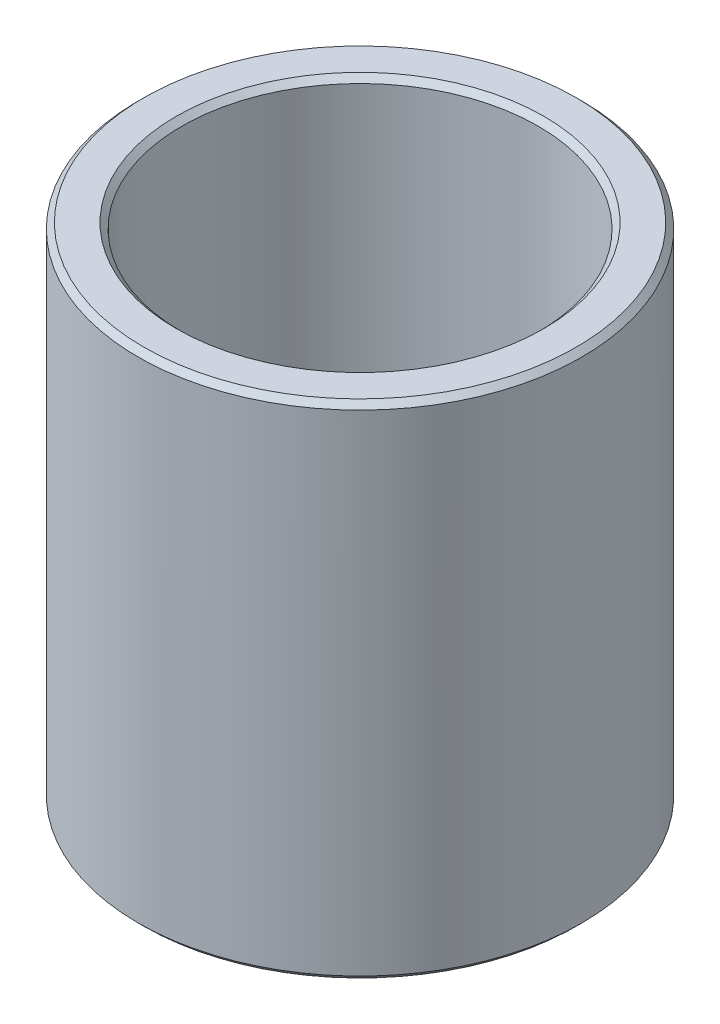
ISO-10303-21;
HEADER;
FILE_DESCRIPTION(('STEP AP214'),'2;1');
FILE_NAME('part.step','',(''),(''),'','','');
FILE_SCHEMA(('AUTOMOTIVE_DESIGN { 1 0 10303 214 1 1 1 1 }'));
ENDSEC;
DATA;
#1=APPLICATION_CONTEXT('core data for automotive mechanical design processes');
#2=APPLICATION_PROTOCOL_DEFINITION('international standard','automotive_design',2000,#1);
#3=PRODUCT_CONTEXT('',#1,'mechanical');
#4=PRODUCT('Part','Part','',(#3));
#5=PRODUCT_RELATED_PRODUCT_CATEGORY('part','',(#4));
#6=PRODUCT_DEFINITION_FORMATION('','',#4);
#7=PRODUCT_DEFINITION_CONTEXT('part definition',#1,'design');
#8=PRODUCT_DEFINITION('design','',#6,#7);
#9=PRODUCT_DEFINITION_SHAPE('','',#8);
#10=(LENGTH_UNIT() NAMED_UNIT(*) SI_UNIT(.MILLI.,.METRE.));
#11=(NAMED_UNIT(*) PLANE_ANGLE_UNIT() SI_UNIT($,.RADIAN.));
#12=(NAMED_UNIT(*) SI_UNIT($,.STERADIAN.) SOLID_ANGLE_UNIT());
#13=UNCERTAINTY_MEASURE_WITH_UNIT(LENGTH_MEASURE(1.E-05),#10,'distance_accuracy_value','');
#14=(GEOMETRIC_REPRESENTATION_CONTEXT(3) GLOBAL_UNCERTAINTY_ASSIGNED_CONTEXT((#13)) GLOBAL_UNIT_ASSIGNED_CONTEXT((#10,
#11,#12)) REPRESENTATION_CONTEXT('',''));
#15=CARTESIAN_POINT('',(0.,0.,0.));
#16=DIRECTION('',(0.,0.,1.));
#17=DIRECTION('',(1.,0.,0.));
#18=AXIS2_PLACEMENT_3D('',#15,#16,#17);
#19=CARTESIAN_POINT('',(0.,33.9125093154234,0.));
#20=DIRECTION('',(0.,-1.,0.));
#21=DIRECTION('',(0.,0.,-1.));
#22=AXIS2_PLACEMENT_3D('',#19,#20,#21);
#23=CYLINDRICAL_SURFACE('',#22,15.);
#24=CARTESIAN_POINT('',(0.,0.384864635886488,0.));
#25=DIRECTION('',(0.,1.,0.));
#26=DIRECTION('',(0.,0.,1.));
#27=AXIS2_PLACEMENT_3D('',#24,#25,#26);
#28=CIRCLE('',#27,15.);
#29=CARTESIAN_POINT('',(0.,0.384864635886481,-15.));
#30=VERTEX_POINT('',#29);
#31=EDGE_CURVE('E10',#30,#30,#28,.T.);
#32=CARTESIAN_POINT('',(0.,33.5276446795369,0.));
#33=DIRECTION('',(0.,1.,0.));
#34=DIRECTION('',(0.,0.,1.));
#35=AXIS2_PLACEMENT_3D('',#32,#33,#34);
#36=CIRCLE('',#35,15.);
#37=CARTESIAN_POINT('',(0.,33.5276446795369,-15.));
#38=VERTEX_POINT('',#37);
#39=EDGE_CURVE('E50',#38,#38,#36,.F.);
#40=CARTESIAN_POINT('',(0.,0.384864635886481,-15.));
#41=CARTESIAN_POINT('',(0.,0.730101928007839,-15.));
#42=CARTESIAN_POINT('',(0.,1.0753392201292,-15.));
#43=CARTESIAN_POINT('',(0.,1.76581380437191,-15.));
#44=CARTESIAN_POINT('',(0.,2.11105109649327,-15.));
#45=CARTESIAN_POINT('',(0.,2.80152568073599,-15.));
#46=CARTESIAN_POINT('',(0.,3.14676297285735,-15.));
#47=CARTESIAN_POINT('',(0.,3.83723755710006,-15.));
#48=CARTESIAN_POINT('',(0.,4.18247484922142,-15.));
#49=CARTESIAN_POINT('',(0.,4.87294943346414,-15.));
#50=CARTESIAN_POINT('',(0.,5.2181867255855,-15.));
#51=CARTESIAN_POINT('',(0.,5.90866130982821,-15.));
#52=CARTESIAN_POINT('',(0.,6.25389860194957,-15.));
#53=CARTESIAN_POINT('',(0.,6.94437318619229,-15.));
#54=CARTESIAN_POINT('',(0.,7.28961047831364,-15.));
#55=CARTESIAN_POINT('',(0.,7.98008506255636,-15.));
#56=CARTESIAN_POINT('',(0.,8.32532235467772,-15.));
#57=CARTESIAN_POINT('',(0.,9.01579693892044,-15.));
#58=CARTESIAN_POINT('',(0.,9.3610342310418,-15.));
#59=CARTESIAN_POINT('',(0.,10.0515088152845,-15.));
#60=CARTESIAN_POINT('',(0.,10.3967461074059,-15.));
#61=CARTESIAN_POINT('',(0.,11.0872206916486,-15.));
#62=CARTESIAN_POINT('',(0.,11.4324579837699,-15.));
#63=CARTESIAN_POINT('',(0.,12.1229325680127,-15.));
#64=CARTESIAN_POINT('',(0.,12.468169860134,-15.));
#65=CARTESIAN_POINT('',(0.,13.1586444443767,-15.));
#66=CARTESIAN_POINT('',(0.,13.5038817364981,-15.));
#67=CARTESIAN_POINT('',(0.,14.1943563207408,-15.));
#68=CARTESIAN_POINT('',(0.,14.5395936128622,-15.));
#69=CARTESIAN_POINT('',(0.,15.2300681971049,-15.));
#70=CARTESIAN_POINT('',(0.,15.5753054892262,-15.));
#71=CARTESIAN_POINT('',(0.,16.265780073469,-15.));
#72=CARTESIAN_POINT('',(0.,16.6110173655903,-15.));
#73=CARTESIAN_POINT('',(0.,17.301491949833,-15.));
#74=CARTESIAN_POINT('',(0.,17.6467292419544,-15.));
#75=CARTESIAN_POINT('',(0.,18.3372038261971,-15.));
#76=CARTESIAN_POINT('',(0.,18.6824411183185,-15.));
#77=CARTESIAN_POINT('',(0.,19.3729157025612,-15.));
#78=CARTESIAN_POINT('',(0.,19.7181529946825,-15.));
#79=CARTESIAN_POINT('',(0.,20.4086275789253,-15.));
#80=CARTESIAN_POINT('',(0.,20.7538648710466,-15.));
#81=CARTESIAN_POINT('',(0.,21.4443394552893,-15.));
#82=CARTESIAN_POINT('',(0.,21.7895767474107,-15.));
#83=CARTESIAN_POINT('',(0.,22.4800513316534,-15.));
#84=CARTESIAN_POINT('',(0.,22.8252886237748,-15.));
#85=CARTESIAN_POINT('',(0.,23.5157632080175,-15.));
#86=CARTESIAN_POINT('',(0.,23.8610005001388,-15.));
#87=CARTESIAN_POINT('',(0.,24.5514750843816,-15.));
#88=CARTESIAN_POINT('',(0.,24.8967123765029,-15.));
#89=CARTESIAN_POINT('',(0.,25.5871869607456,-15.));
#90=CARTESIAN_POINT('',(0.,25.932424252867,-15.));
#91=CARTESIAN_POINT('',(0.,26.6228988371097,-15.));
#92=CARTESIAN_POINT('',(0.,26.9681361292311,-15.));
#93=CARTESIAN_POINT('',(0.,27.6586107134738,-15.));
#94=CARTESIAN_POINT('',(0.,28.0038480055951,-15.));
#95=CARTESIAN_POINT('',(0.,28.6943225898378,-15.));
#96=CARTESIAN_POINT('',(0.,29.0395598819592,-15.));
#97=CARTESIAN_POINT('',(0.,29.7300344662019,-15.));
#98=CARTESIAN_POINT('',(0.,30.0752717583233,-15.));
#99=CARTESIAN_POINT('',(0.,30.765746342566,-15.));
#100=CARTESIAN_POINT('',(0.,31.1109836346874,-15.));
#101=CARTESIAN_POINT('',(0.,31.8014582189301,-15.));
#102=CARTESIAN_POINT('',(0.,32.1466955110514,-15.));
#103=CARTESIAN_POINT('',(0.,32.8371700952942,-15.));
#104=CARTESIAN_POINT('',(0.,33.1824073874155,-15.));
#105=CARTESIAN_POINT('',(0.,33.5276446795369,-15.));
#106=B_SPLINE_CURVE_WITH_KNOTS('',3,(#40,#41,#42,#43,#44,#45,#46,#47,#48,#49,#50,#51,#52,#53,
#54,#55,#56,#57,#58,#59,#60,#61,#62,#63,#64,#65,#66,#67,#68,#69,#70,#71,#72,#73,#74,#75,#76,#77,
#78,#79,#80,#81,#82,#83,#84,#85,#86,#87,#88,#89,#90,#91,#92,#93,#94,#95,#96,#97,#98,#99,#100,
#101,#102,#103,#104,#105),.UNSPECIFIED.,.F.,.F.,(4,2,2,2,2,2,2,2,2,2,2,2,2,2,2,2,2,2,2,2,2,2,2,
2,2,2,2,2,2,2,2,2,4),(0.,1.03571187636407,2.07142375272815,3.10713562909222,4.1428475054563,
5.17855938182037,6.21427125818445,7.24998313454852,8.2856950109126,9.32140688727667,
10.3571187636407,11.3928306400048,12.4285425163689,13.464254392733,14.499966269097,
15.5356781454611,16.5713900218252,17.6071018981893,18.6428137745533,19.6785256509174,
20.7142375272815,21.7499494036456,22.7856612800096,23.8213731563737,24.8570850327378,
25.8927969091019,26.9285087854659,27.96422066183,28.9999325381941,30.0356444145582,
31.0713562909222,32.1070681672863,33.1427800436504),.UNSPECIFIED.);
#107=EDGE_CURVE('BSEAM39',#30,#38,#106,.T.);
#108=ORIENTED_EDGE('',*,*,#31,.T.);
#109=ORIENTED_EDGE('',*,*,#39,.T.);
#110=ORIENTED_EDGE('',*,*,#107,.T.);
#111=ORIENTED_EDGE('',*,*,#107,.F.);
#112=EDGE_LOOP('',(#108,#110,#109,#111));
#113=FACE_BOUND('',#112,.T.);
#114=ADVANCED_FACE('F39',(#113),#23,.T.);
#115=CARTESIAN_POINT('',(0.,33.9125093154234,0.));
#116=DIRECTION('',(0.,1.,0.));
#117=DIRECTION('',(0.,0.,1.));
#118=AXIS2_PLACEMENT_3D('',#115,#116,#117);
#119=PLANE('',#118);
#120=CARTESIAN_POINT('',(0.,33.9125093154234,0.));
#121=DIRECTION('',(0.,1.,0.));
#122=DIRECTION('',(0.,0.,1.));
#123=AXIS2_PLACEMENT_3D('',#120,#121,#122);
#124=CIRCLE('',#123,12.4342542107349);
#125=CARTESIAN_POINT('',(0.,33.9125093154234,12.4342542107349));
#126=VERTEX_POINT('',#125);
#127=EDGE_CURVE('E58',#126,#126,#124,.F.);
#128=ORIENTED_EDGE('',*,*,#127,.T.);
#129=EDGE_LOOP('',(#128));
#130=FACE_BOUND('',#129,.T.);
#131=CARTESIAN_POINT('',(0.,33.9125093154234,0.));
#132=DIRECTION('',(0.,1.,0.));
#133=DIRECTION('',(0.,0.,1.));
#134=AXIS2_PLACEMENT_3D('',#131,#132,#133);
#135=CIRCLE('',#134,14.6151353641135);
#136=CARTESIAN_POINT('',(0.,33.9125093154234,-14.6151353641135));
#137=VERTEX_POINT('',#136);
#138=EDGE_CURVE('E61',#137,#137,#135,.T.);
#139=ORIENTED_EDGE('',*,*,#138,.T.);
#140=EDGE_LOOP('',(#139));
#141=FACE_BOUND('',#140,.T.);
#142=ADVANCED_FACE('F88',(#130,#141),#119,.T.);
#143=CARTESIAN_POINT('',(0.,0.,0.));
#144=DIRECTION('',(0.,1.,0.));
#145=DIRECTION('',(0.,0.,1.));
#146=AXIS2_PLACEMENT_3D('',#143,#144,#145);
#147=PLANE('',#146);
#148=CARTESIAN_POINT('',(0.,0.,0.));
#149=DIRECTION('',(0.,1.,0.));
#150=DIRECTION('',(0.,0.,1.));
#151=AXIS2_PLACEMENT_3D('',#148,#149,#150);
#152=CIRCLE('',#151,12.4342542107349);
#153=CARTESIAN_POINT('',(0.,0.,-12.4342542107349));
#154=VERTEX_POINT('',#153);
#155=EDGE_CURVE('E51',#154,#154,#152,.T.);
#156=ORIENTED_EDGE('',*,*,#155,.T.);
#157=EDGE_LOOP('',(#156));
#158=FACE_BOUND('',#157,.T.);
#159=CARTESIAN_POINT('',(0.,0.,0.));
#160=DIRECTION('',(0.,1.,0.));
#161=DIRECTION('',(0.,0.,1.));
#162=AXIS2_PLACEMENT_3D('',#159,#160,#161);
#163=CIRCLE('',#162,14.6151353641135);
#164=CARTESIAN_POINT('',(0.,0.,14.6151353641135));
#165=VERTEX_POINT('',#164);
#166=EDGE_CURVE('E54',#165,#165,#163,.F.);
#167=ORIENTED_EDGE('',*,*,#166,.T.);
#168=EDGE_LOOP('',(#167));
#169=FACE_BOUND('',#168,.T.);
#170=ADVANCED_FACE('F83',(#158,#169),#147,.F.);
#171=CARTESIAN_POINT('',(0.,33.9125093154234,0.));
#172=DIRECTION('',(0.,-1.,0.));
#173=DIRECTION('',(0.,0.,-1.));
#174=AXIS2_PLACEMENT_3D('',#171,#172,#173);
#175=CYLINDRICAL_SURFACE('',#174,12.0493895748484);
#176=CARTESIAN_POINT('',(0.,33.5276446795369,0.));
#177=DIRECTION('',(0.,1.,0.));
#178=DIRECTION('',(0.,0.,1.));
#179=AXIS2_PLACEMENT_3D('',#176,#177,#178);
#180=CIRCLE('',#179,12.0493895748484);
#181=CARTESIAN_POINT('',(0.,33.5276446795369,12.0493895748484));
#182=VERTEX_POINT('',#181);
#183=EDGE_CURVE('E67',#182,#182,#180,.T.);
#184=ORIENTED_EDGE('',*,*,#183,.T.);
#185=EDGE_LOOP('',(#184));
#186=FACE_BOUND('',#185,.T.);
#187=CARTESIAN_POINT('',(0.,0.384864635886488,0.));
#188=DIRECTION('',(0.,1.,0.));
#189=DIRECTION('',(0.,0.,1.));
#190=AXIS2_PLACEMENT_3D('',#187,#188,#189);
#191=CIRCLE('',#190,12.0493895748484);
#192=CARTESIAN_POINT('',(0.,0.384864635886488,-12.0493895748484));
#193=VERTEX_POINT('',#192);
#194=EDGE_CURVE('E69',#193,#193,#191,.F.);
#195=ORIENTED_EDGE('',*,*,#194,.T.);
#196=EDGE_LOOP('',(#195));
#197=FACE_BOUND('',#196,.T.);
#198=ADVANCED_FACE('F71',(#186,#197),#175,.F.);
#199=CARTESIAN_POINT('',(0.,33.5276446795369,0.));
#200=DIRECTION('',(0.,1.,0.));
#201=DIRECTION('',(0.,0.,1.));
#202=AXIS2_PLACEMENT_3D('',#199,#200,#201);
#203=CONICAL_SURFACE('',#202,12.0493895748484,0.785398163397446);
#204=ORIENTED_EDGE('',*,*,#127,.F.);
#205=EDGE_LOOP('',(#204));
#206=FACE_BOUND('',#205,.T.);
#207=ORIENTED_EDGE('',*,*,#183,.F.);
#208=EDGE_LOOP('',(#207));
#209=FACE_BOUND('',#208,.T.);
#210=ADVANCED_FACE('F77',(#206,#209),#203,.F.);
#211=CARTESIAN_POINT('',(0.,0.,0.));
#212=DIRECTION('',(0.,-1.,0.));
#213=DIRECTION('',(0.,0.,-1.));
#214=AXIS2_PLACEMENT_3D('',#211,#212,#213);
#215=CONICAL_SURFACE('',#214,12.4342542107349,0.785398163397451);
#216=CARTESIAN_POINT('',(0.,0.384864635886488,-12.0493895748484));
#217=CARTESIAN_POINT('',(0.,0.38085562926267,-12.0533985814722));
#218=CARTESIAN_POINT('',(0.,0.376846622638853,-12.057407588096));
#219=CARTESIAN_POINT('',(0.,0.368828609391218,-12.0654256013436));
#220=CARTESIAN_POINT('',(0.,0.3648196027674,-12.0694346079675));
#221=CARTESIAN_POINT('',(0.,0.356801589519765,-12.0774526212151));
#222=CARTESIAN_POINT('',(0.,0.352792582895947,-12.0814616278389));
#223=CARTESIAN_POINT('',(0.,0.344774569648312,-12.0894796410865));
#224=CARTESIAN_POINT('',(0.,0.340765563024495,-12.0934886477104));
#225=CARTESIAN_POINT('',(0.,0.332747549776859,-12.101506660958));
#226=CARTESIAN_POINT('',(0.,0.328738543153042,-12.1055156675818));
#227=CARTESIAN_POINT('',(0.,0.320720529905406,-12.1135336808295));
#228=CARTESIAN_POINT('',(0.,0.316711523281589,-12.1175426874533));
#229=CARTESIAN_POINT('',(0.,0.308693510033954,-12.1255607007009));
#230=CARTESIAN_POINT('',(0.,0.304684503410136,-12.1295697073247));
#231=CARTESIAN_POINT('',(0.,0.296666490162501,-12.1375877205724));
#232=CARTESIAN_POINT('',(0.,0.292657483538683,-12.1415967271962));
#233=CARTESIAN_POINT('',(0.,0.284639470291048,-12.1496147404438));
#234=CARTESIAN_POINT('',(0.,0.280630463667231,-12.1536237470676));
#235=CARTESIAN_POINT('',(0.,0.272612450419596,-12.1616417603153));
#236=CARTESIAN_POINT('',(0.,0.268603443795778,-12.1656507669391));
#237=CARTESIAN_POINT('',(0.,0.260585430548143,-12.1736687801867));
#238=CARTESIAN_POINT('',(0.,0.256576423924325,-12.1776777868105));
#239=CARTESIAN_POINT('',(0.,0.24855841067669,-12.1856958000582));
#240=CARTESIAN_POINT('',(0.,0.244549404052873,-12.189704806682));
#241=CARTESIAN_POINT('',(0.,0.236531390805237,-12.1977228199296));
#242=CARTESIAN_POINT('',(0.,0.23252238418142,-12.2017318265534));
#243=CARTESIAN_POINT('',(0.,0.224504370933785,-12.2097498398011));
#244=CARTESIAN_POINT('',(0.,0.220495364309967,-12.2137588464249));
#245=CARTESIAN_POINT('',(0.,0.212477351062332,-12.2217768596725));
#246=CARTESIAN_POINT('',(0.,0.208468344438514,-12.2257858662963));
#247=CARTESIAN_POINT('',(0.,0.200450331190879,-12.233803879544));
#248=CARTESIAN_POINT('',(0.,0.196441324567061,-12.2378128861678));
#249=CARTESIAN_POINT('',(0.,0.188423311319426,-12.2458308994154));
#250=CARTESIAN_POINT('',(0.,0.184414304695609,-12.2498399060393));
#251=CARTESIAN_POINT('',(0.,0.176396291447974,-12.2578579192869));
#252=CARTESIAN_POINT('',(0.,0.172387284824156,-12.2618669259107));
#253=CARTESIAN_POINT('',(0.,0.164369271576521,-12.2698849391583));
#254=CARTESIAN_POINT('',(0.,0.160360264952703,-12.2738939457822));
#255=CARTESIAN_POINT('',(0.,0.152342251705068,-12.2819119590298));
#256=CARTESIAN_POINT('',(0.,0.148333245081251,-12.2859209656536));
#257=CARTESIAN_POINT('',(0.,0.140315231833615,-12.2939389789012));
#258=CARTESIAN_POINT('',(0.,0.136306225209798,-12.2979479855251));
#259=CARTESIAN_POINT('',(0.,0.128288211962163,-12.3059659987727));
#260=CARTESIAN_POINT('',(0.,0.124279205338345,-12.3099750053965));
#261=CARTESIAN_POINT('',(0.,0.11626119209071,-12.3179930186442));
#262=CARTESIAN_POINT('',(0.,0.112252185466892,-12.322002025268));
#263=CARTESIAN_POINT('',(0.,0.104234172219257,-12.3300200385156));
#264=CARTESIAN_POINT('',(0.,0.10022516559544,-12.3340290451394));
#265=CARTESIAN_POINT('',(0.,0.0922071523478044,-12.3420470583871));
#266=CARTESIAN_POINT('',(0.,0.0881981457239868,-12.3460560650109));
#267=CARTESIAN_POINT('',(0.,0.0801801324763517,-12.3540740782585));
#268=CARTESIAN_POINT('',(0.,0.0761711258525342,-12.3580830848823));
#269=CARTESIAN_POINT('',(0.,0.068153112604899,-12.36610109813));
#270=CARTESIAN_POINT('',(0.,0.0641441059810812,-12.3701101047538));
#271=CARTESIAN_POINT('',(0.,0.056126092733446,-12.3781281180014));
#272=CARTESIAN_POINT('',(0.,0.0521170861096285,-12.3821371246252));
#273=CARTESIAN_POINT('',(0.,0.0440990728619935,-12.3901551378729));
#274=CARTESIAN_POINT('',(0.,0.0400900662381758,-12.3941641444967));
#275=CARTESIAN_POINT('',(0.,0.0320720529905406,-12.4021821577443));
#276=CARTESIAN_POINT('',(0.,0.0280630463667231,-12.4061911643681));
#277=CARTESIAN_POINT('',(0.,0.0200450331190879,-12.4142091776158));
#278=CARTESIAN_POINT('',(0.,0.0160360264952703,-12.4182181842396));
#279=CARTESIAN_POINT('',(0.,0.00801801324763516,-12.4262361974872));
#280=CARTESIAN_POINT('',(0.,0.00400900662381758,-12.430245204111));
#281=CARTESIAN_POINT('',(0.,0.,-12.4342542107349));
#282=B_SPLINE_CURVE_WITH_KNOTS('',3,(#216,#217,#218,#219,#220,#221,#222,#223,#224,#225,#226,
#227,#228,#229,#230,#231,#232,#233,#234,#235,#236,#237,#238,#239,#240,#241,#242,#243,#244,#245,
#246,#247,#248,#249,#250,#251,#252,#253,#254,#255,#256,#257,#258,#259,#260,#261,#262,#263,#264,
#265,#266,#267,#268,#269,#270,#271,#272,#273,#274,#275,#276,#277,#278,#279,#280,#281),
.UNSPECIFIED.,.F.,.F.,(4,2,2,2,2,2,2,2,2,2,2,2,2,2,2,2,2,2,2,2,2,2,2,2,2,2,2,2,2,2,2,2,4),(0.,
0.0170087746171394,0.0340175492342787,0.0510263238514181,0.0680350984685574,0.0850438730856955,
0.102052647702835,0.119061422319974,0.136070196937114,0.153078971554253,0.170087746171392,
0.187096520788532,0.204105295405671,0.22111407002281,0.23812284463995,0.255131619257089,
0.272140393874227,0.289149168491367,0.306157943108506,0.323166717725645,0.340175492342785,
0.357184266959924,0.374193041577063,0.391201816194203,0.408210590811342,0.425219365428481,
0.442228140045621,0.459236914662759,0.476245689279898,0.493254463897038,0.510263238514177,
0.527272013131316,0.544280787748456),.UNSPECIFIED.);
#283=EDGE_CURVE('BSEAM73',#193,#154,#282,.T.);
#284=ORIENTED_EDGE('',*,*,#194,.F.);
#285=ORIENTED_EDGE('',*,*,#155,.F.);
#286=ORIENTED_EDGE('',*,*,#283,.T.);
#287=ORIENTED_EDGE('',*,*,#283,.F.);
#288=EDGE_LOOP('',(#284,#286,#285,#287));
#289=FACE_BOUND('',#288,.T.);
#290=ADVANCED_FACE('F73',(#289),#215,.F.);
#291=CARTESIAN_POINT('',(0.,0.384864635886488,0.));
#292=DIRECTION('',(0.,1.,0.));
#293=DIRECTION('',(0.,0.,1.));
#294=AXIS2_PLACEMENT_3D('',#291,#292,#293);
#295=CONICAL_SURFACE('',#294,15.,0.785398163397453);
#296=ORIENTED_EDGE('',*,*,#166,.F.);
#297=EDGE_LOOP('',(#296));
#298=FACE_BOUND('',#297,.T.);
#299=ORIENTED_EDGE('',*,*,#31,.F.);
#300=EDGE_LOOP('',(#299));
#301=FACE_BOUND('',#300,.T.);
#302=ADVANCED_FACE('F76',(#298,#301),#295,.T.);
#303=CARTESIAN_POINT('',(0.,33.9125093154234,0.));
#304=DIRECTION('',(0.,-1.,0.));
#305=DIRECTION('',(0.,0.,-1.));
#306=AXIS2_PLACEMENT_3D('',#303,#304,#305);
#307=CONICAL_SURFACE('',#306,14.6151353641135,0.785398163397439);
#308=CARTESIAN_POINT('',(0.,33.5276446795369,-15.));
#309=CARTESIAN_POINT('',(0.,33.5316536861607,-14.9959909933762));
#310=CARTESIAN_POINT('',(0.,33.5356626927845,-14.9919819867524));
#311=CARTESIAN_POINT('',(0.,33.5436807060321,-14.9839639735047));
#312=CARTESIAN_POINT('',(0.,33.547689712656,-14.9799549668809));
#313=CARTESIAN_POINT('',(0.,33.5557077259036,-14.9719369536333));
#314=CARTESIAN_POINT('',(0.,33.5597167325274,-14.9679279470095));
#315=CARTESIAN_POINT('',(0.,33.567734745775,-14.9599099337618));
#316=CARTESIAN_POINT('',(0.,33.5717437523989,-14.955900927138));
#317=CARTESIAN_POINT('',(0.,33.5797617656465,-14.9478829138904));
#318=CARTESIAN_POINT('',(0.,33.5837707722703,-14.9438739072666));
#319=CARTESIAN_POINT('',(0.,33.591788785518,-14.9358558940189));
#320=CARTESIAN_POINT('',(0.,33.5957977921418,-14.9318468873951));
#321=CARTESIAN_POINT('',(0.,33.6038158053894,-14.9238288741475));
#322=CARTESIAN_POINT('',(0.,33.6078248120132,-14.9198198675237));
#323=CARTESIAN_POINT('',(0.,33.6158428252609,-14.911801854276));
#324=CARTESIAN_POINT('',(0.,33.6198518318847,-14.9077928476522));
#325=CARTESIAN_POINT('',(0.,33.6278698451323,-14.8997748344046));
#326=CARTESIAN_POINT('',(0.,33.6318788517561,-14.8957658277807));
#327=CARTESIAN_POINT('',(0.,33.6398968650038,-14.8877478145331));
#328=CARTESIAN_POINT('',(0.,33.6439058716276,-14.8837388079093));
#329=CARTESIAN_POINT('',(0.,33.6519238848752,-14.8757207946617));
#330=CARTESIAN_POINT('',(0.,33.655932891499,-14.8717117880378));
#331=CARTESIAN_POINT('',(0.,33.6639509047467,-14.8636937747902));
#332=CARTESIAN_POINT('',(0.,33.6679599113705,-14.8596847681664));
#333=CARTESIAN_POINT('',(0.,33.6759779246181,-14.8516667549188));
#334=CARTESIAN_POINT('',(0.,33.6799869312419,-14.8476577482949));
#335=CARTESIAN_POINT('',(0.,33.6880049444896,-14.8396397350473));
#336=CARTESIAN_POINT('',(0.,33.6920139511134,-14.8356307284235));
#337=CARTESIAN_POINT('',(0.,33.700031964361,-14.8276127151758));
#338=CARTESIAN_POINT('',(0.,33.7040409709848,-14.823603708552));
#339=CARTESIAN_POINT('',(0.,33.7120589842325,-14.8155856953044));
#340=CARTESIAN_POINT('',(0.,33.7160679908563,-14.8115766886806));
#341=CARTESIAN_POINT('',(0.,33.7240860041039,-14.8035586754329));
#342=CARTESIAN_POINT('',(0.,33.7280950107277,-14.7995496688091));
#343=CARTESIAN_POINT('',(0.,33.7361130239754,-14.7915316555615));
#344=CARTESIAN_POINT('',(0.,33.7401220305992,-14.7875226489377));
#345=CARTESIAN_POINT('',(0.,33.7481400438468,-14.77950463569));
#346=CARTESIAN_POINT('',(0.,33.7521490504706,-14.7754956290662));
#347=CARTESIAN_POINT('',(0.,33.7601670637183,-14.7674776158186));
#348=CARTESIAN_POINT('',(0.,33.7641760703421,-14.7634686091948));
#349=CARTESIAN_POINT('',(0.,33.7721940835897,-14.7554505959471));
#350=CARTESIAN_POINT('',(0.,33.7762030902136,-14.7514415893233));
#351=CARTESIAN_POINT('',(0.,33.7842211034612,-14.7434235760757));
#352=CARTESIAN_POINT('',(0.,33.788230110085,-14.7394145694519));
#353=CARTESIAN_POINT('',(0.,33.7962481233327,-14.7313965562042));
#354=CARTESIAN_POINT('',(0.,33.8002571299565,-14.7273875495804));
#355=CARTESIAN_POINT('',(0.,33.8082751432041,-14.7193695363328));
#356=CARTESIAN_POINT('',(0.,33.8122841498279,-14.715360529709));
#357=CARTESIAN_POINT('',(0.,33.8203021630756,-14.7073425164613));
#358=CARTESIAN_POINT('',(0.,33.8243111696994,-14.7033335098375));
#359=CARTESIAN_POINT('',(0.,33.832329182947,-14.6953154965899));
#360=CARTESIAN_POINT('',(0.,33.8363381895708,-14.6913064899661));
#361=CARTESIAN_POINT('',(0.,33.8443562028185,-14.6832884767184));
#362=CARTESIAN_POINT('',(0.,33.8483652094423,-14.6792794700946));
#363=CARTESIAN_POINT('',(0.,33.8563832226899,-14.671261456847));
#364=CARTESIAN_POINT('',(0.,33.8603922293137,-14.6672524502232));
#365=CARTESIAN_POINT('',(0.,33.8684102425614,-14.6592344369755));
#366=CARTESIAN_POINT('',(0.,33.8724192491852,-14.6552254303517));
#367=CARTESIAN_POINT('',(0.,33.8804372624328,-14.6472074171041));
#368=CARTESIAN_POINT('',(0.,33.8844462690566,-14.6431984104802));
#369=CARTESIAN_POINT('',(0.,33.8924642823043,-14.6351803972326));
#370=CARTESIAN_POINT('',(0.,33.8964732889281,-14.6311713906088));
#371=CARTESIAN_POINT('',(0.,33.9044913021757,-14.6231533773612));
#372=CARTESIAN_POINT('',(0.,33.9085003087995,-14.6191443707373));
#373=CARTESIAN_POINT('',(0.,33.9125093154234,-14.6151353641135));
#374=B_SPLINE_CURVE_WITH_KNOTS('',3,(#308,#309,#310,#311,#312,#313,#314,#315,#316,#317,#318,
#319,#320,#321,#322,#323,#324,#325,#326,#327,#328,#329,#330,#331,#332,#333,#334,#335,#336,#337,
#338,#339,#340,#341,#342,#343,#344,#345,#346,#347,#348,#349,#350,#351,#352,#353,#354,#355,#356,
#357,#358,#359,#360,#361,#362,#363,#364,#365,#366,#367,#368,#369,#370,#371,#372,#373),
.UNSPECIFIED.,.F.,.F.,(4,2,2,2,2,2,2,2,2,2,2,2,2,2,2,2,2,2,2,2,2,2,2,2,2,2,2,2,2,2,2,2,4),(0.,
0.0170087746171371,0.0340175492342741,0.0510263238514148,0.0680350984685519,0.0850438730856938,
0.10205264770283,0.119061422319972,0.136070196937109,0.153078971554251,0.170087746171388,
0.187096520788528,0.204105295405665,0.221114070022807,0.238122844639944,0.255131619257085,
0.272140393874222,0.289149168491359,0.306157943108501,0.323166717725637,0.340175492342779,
0.357184266959916,0.374193041577058,0.391201816194194,0.408210590811336,0.425219365428473,
0.442228140045615,0.459236914662751,0.476245689279893,0.49325446389703,0.51026323851417,
0.527272013131307,0.544280787748449),.UNSPECIFIED.);
#375=EDGE_CURVE('BSEAM45',#38,#137,#374,.T.);
#376=ORIENTED_EDGE('',*,*,#39,.F.);
#377=ORIENTED_EDGE('',*,*,#138,.F.);
#378=ORIENTED_EDGE('',*,*,#375,.T.);
#379=ORIENTED_EDGE('',*,*,#375,.F.);
#380=EDGE_LOOP('',(#376,#378,#377,#379));
#381=FACE_BOUND('',#380,.T.);
#382=ADVANCED_FACE('F45',(#381),#307,.T.);
#383=CLOSED_SHELL('',(#114,#142,#170,#198,#210,#290,#302,#382));
#384=MANIFOLD_SOLID_BREP('B2',#383);
#385=ADVANCED_BREP_SHAPE_REPRESENTATION('',(#18,#384),#14);
#386=SHAPE_DEFINITION_REPRESENTATION(#9,#385);
ENDSEC;
END-ISO-10303-21;
